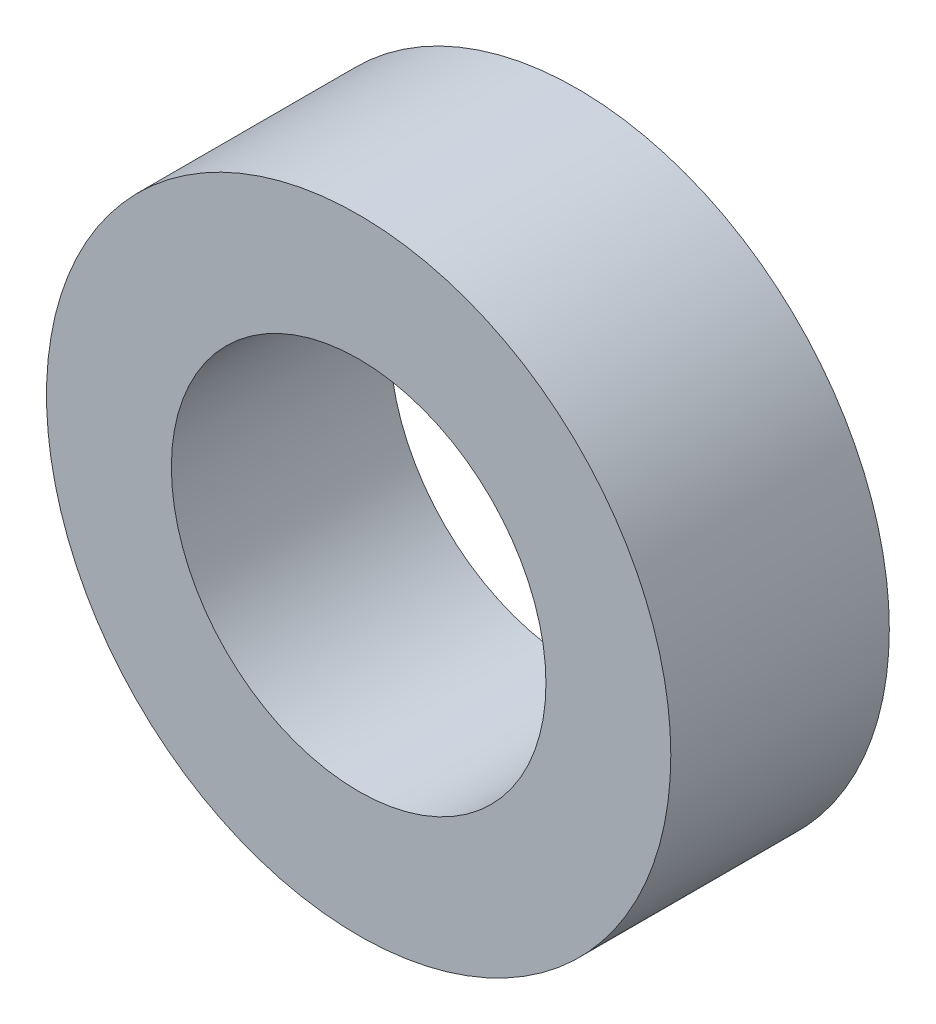
ISO-10303-21;
HEADER;
FILE_DESCRIPTION(('STEP AP214'),'2;1');
FILE_NAME('part.step','',(''),(''),'','','');
FILE_SCHEMA(('AUTOMOTIVE_DESIGN { 1 0 10303 214 1 1 1 1 }'));
ENDSEC;
DATA;
#1=APPLICATION_CONTEXT('core data for automotive mechanical design processes');
#2=APPLICATION_PROTOCOL_DEFINITION('international standard','automotive_design',2000,#1);
#3=PRODUCT_CONTEXT('',#1,'mechanical');
#4=PRODUCT('Part','Part','',(#3));
#5=PRODUCT_RELATED_PRODUCT_CATEGORY('part','',(#4));
#6=PRODUCT_DEFINITION_FORMATION('','',#4);
#7=PRODUCT_DEFINITION_CONTEXT('part definition',#1,'design');
#8=PRODUCT_DEFINITION('design','',#6,#7);
#9=PRODUCT_DEFINITION_SHAPE('','',#8);
#10=(LENGTH_UNIT() NAMED_UNIT(*) SI_UNIT(.MILLI.,.METRE.));
#11=(NAMED_UNIT(*) PLANE_ANGLE_UNIT() SI_UNIT($,.RADIAN.));
#12=(NAMED_UNIT(*) SI_UNIT($,.STERADIAN.) SOLID_ANGLE_UNIT());
#13=UNCERTAINTY_MEASURE_WITH_UNIT(LENGTH_MEASURE(1.E-05),#10,'distance_accuracy_value','');
#14=(GEOMETRIC_REPRESENTATION_CONTEXT(3) GLOBAL_UNCERTAINTY_ASSIGNED_CONTEXT((#13)) GLOBAL_UNIT_ASSIGNED_CONTEXT((#10,
#11,#12)) REPRESENTATION_CONTEXT('',''));
#15=CARTESIAN_POINT('',(0.,0.,0.));
#16=DIRECTION('',(0.,0.,1.));
#17=DIRECTION('',(1.,0.,0.));
#18=AXIS2_PLACEMENT_3D('',#15,#16,#17);
#19=CARTESIAN_POINT('',(0.,0.,7.));
#20=DIRECTION('',(0.,0.,1.));
#21=DIRECTION('',(1.,0.,0.));
#22=AXIS2_PLACEMENT_3D('',#19,#20,#21);
#23=PLANE('',#22);
#24=CARTESIAN_POINT('',(0.,0.,7.));
#25=DIRECTION('',(0.,0.,1.));
#26=DIRECTION('',(1.,0.,0.));
#27=AXIS2_PLACEMENT_3D('',#24,#25,#26);
#28=CIRCLE('',#27,10.);
#29=CARTESIAN_POINT('',(10.,0.,7.));
#30=VERTEX_POINT('',#29);
#31=EDGE_CURVE('E10',#30,#30,#28,.T.);
#32=ORIENTED_EDGE('',*,*,#31,.T.);
#33=EDGE_LOOP('',(#32));
#34=FACE_BOUND('',#33,.T.);
#35=CARTESIAN_POINT('',(0.,0.,7.));
#36=DIRECTION('',(0.,0.,1.));
#37=DIRECTION('',(1.,0.,0.));
#38=AXIS2_PLACEMENT_3D('',#35,#36,#37);
#39=CIRCLE('',#38,6.);
#40=CARTESIAN_POINT('',(6.,0.,7.));
#41=VERTEX_POINT('',#40);
#42=EDGE_CURVE('E46',#41,#41,#39,.T.);
#43=ORIENTED_EDGE('',*,*,#42,.F.);
#44=EDGE_LOOP('',(#43));
#45=FACE_BOUND('',#44,.T.);
#46=ADVANCED_FACE('F35',(#34,#45),#23,.T.);
#47=CARTESIAN_POINT('',(0.,0.,0.));
#48=DIRECTION('',(0.,0.,1.));
#49=DIRECTION('',(1.,0.,0.));
#50=AXIS2_PLACEMENT_3D('',#47,#48,#49);
#51=PLANE('',#50);
#52=CARTESIAN_POINT('',(0.,0.,0.));
#53=DIRECTION('',(0.,0.,1.));
#54=DIRECTION('',(1.,0.,0.));
#55=AXIS2_PLACEMENT_3D('',#52,#53,#54);
#56=CIRCLE('',#55,10.);
#57=CARTESIAN_POINT('',(10.,0.,0.));
#58=VERTEX_POINT('',#57);
#59=EDGE_CURVE('E39',#58,#58,#56,.T.);
#60=ORIENTED_EDGE('',*,*,#59,.F.);
#61=EDGE_LOOP('',(#60));
#62=FACE_BOUND('',#61,.T.);
#63=CARTESIAN_POINT('',(0.,0.,0.));
#64=DIRECTION('',(0.,0.,1.));
#65=DIRECTION('',(1.,0.,0.));
#66=AXIS2_PLACEMENT_3D('',#63,#64,#65);
#67=CIRCLE('',#66,6.);
#68=CARTESIAN_POINT('',(6.,0.,0.));
#69=VERTEX_POINT('',#68);
#70=EDGE_CURVE('E48',#69,#69,#67,.T.);
#71=ORIENTED_EDGE('',*,*,#70,.T.);
#72=EDGE_LOOP('',(#71));
#73=FACE_BOUND('',#72,.T.);
#74=ADVANCED_FACE('F58',(#62,#73),#51,.F.);
#75=CARTESIAN_POINT('',(0.,0.,7.));
#76=DIRECTION('',(0.,0.,-1.));
#77=DIRECTION('',(-1.,0.,0.));
#78=AXIS2_PLACEMENT_3D('',#75,#76,#77);
#79=CYLINDRICAL_SURFACE('',#78,10.);
#80=ORIENTED_EDGE('',*,*,#31,.F.);
#81=EDGE_LOOP('',(#80));
#82=FACE_BOUND('',#81,.T.);
#83=ORIENTED_EDGE('',*,*,#59,.T.);
#84=EDGE_LOOP('',(#83));
#85=FACE_BOUND('',#84,.T.);
#86=ADVANCED_FACE('F37',(#82,#85),#79,.T.);
#87=CARTESIAN_POINT('',(0.,0.,7.));
#88=DIRECTION('',(0.,0.,-1.));
#89=DIRECTION('',(-1.,0.,0.));
#90=AXIS2_PLACEMENT_3D('',#87,#88,#89);
#91=CYLINDRICAL_SURFACE('',#90,6.);
#92=ORIENTED_EDGE('',*,*,#42,.T.);
#93=EDGE_LOOP('',(#92));
#94=FACE_BOUND('',#93,.T.);
#95=ORIENTED_EDGE('',*,*,#70,.F.);
#96=EDGE_LOOP('',(#95));
#97=FACE_BOUND('',#96,.T.);
#98=ADVANCED_FACE('F54',(#94,#97),#91,.F.);
#99=CLOSED_SHELL('',(#46,#74,#86,#98));
#100=MANIFOLD_SOLID_BREP('B2',#99);
#101=ADVANCED_BREP_SHAPE_REPRESENTATION('',(#18,#100),#14);
#102=SHAPE_DEFINITION_REPRESENTATION(#9,#101);
ENDSEC;
END-ISO-10303-21;
